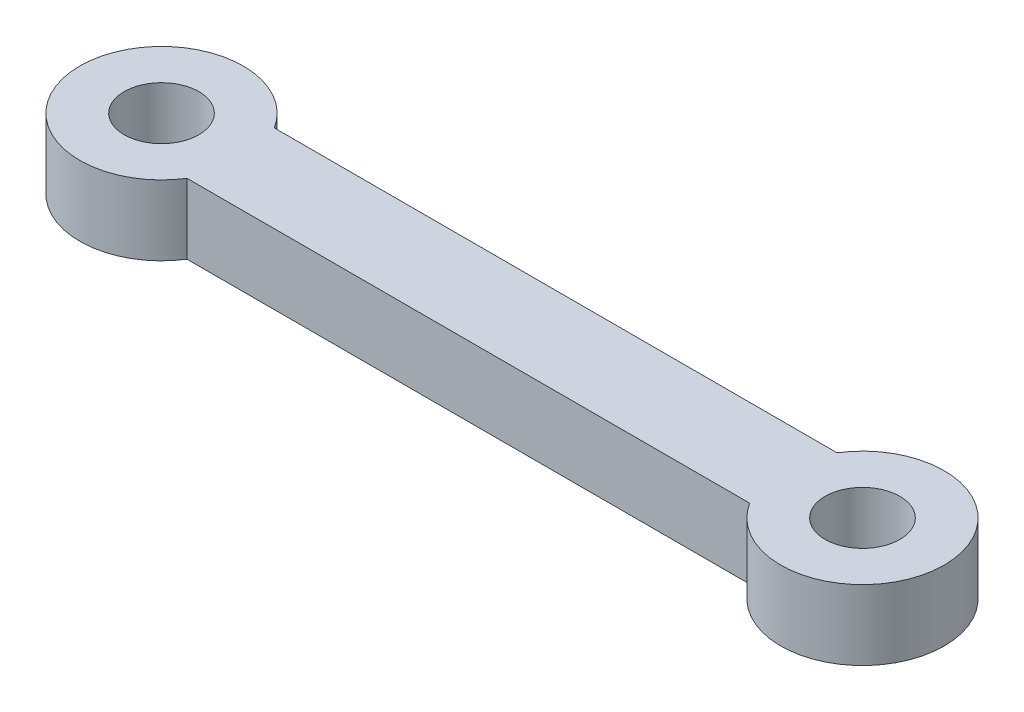
ISO-10303-21;
HEADER;
FILE_DESCRIPTION(('STEP AP214'),'2;1');
FILE_NAME('part.step','',(''),(''),'','','');
FILE_SCHEMA(('AUTOMOTIVE_DESIGN { 1 0 10303 214 1 1 1 1 }'));
ENDSEC;
DATA;
#1=APPLICATION_CONTEXT('core data for automotive mechanical design processes');
#2=APPLICATION_PROTOCOL_DEFINITION('international standard','automotive_design',2000,#1);
#3=PRODUCT_CONTEXT('',#1,'mechanical');
#4=PRODUCT('Part','Part','',(#3));
#5=PRODUCT_RELATED_PRODUCT_CATEGORY('part','',(#4));
#6=PRODUCT_DEFINITION_FORMATION('','',#4);
#7=PRODUCT_DEFINITION_CONTEXT('part definition',#1,'design');
#8=PRODUCT_DEFINITION('design','',#6,#7);
#9=PRODUCT_DEFINITION_SHAPE('','',#8);
#10=(LENGTH_UNIT() NAMED_UNIT(*) SI_UNIT(.MILLI.,.METRE.));
#11=(NAMED_UNIT(*) PLANE_ANGLE_UNIT() SI_UNIT($,.RADIAN.));
#12=(NAMED_UNIT(*) SI_UNIT($,.STERADIAN.) SOLID_ANGLE_UNIT());
#13=UNCERTAINTY_MEASURE_WITH_UNIT(LENGTH_MEASURE(1.E-05),#10,'distance_accuracy_value','');
#14=(GEOMETRIC_REPRESENTATION_CONTEXT(3) GLOBAL_UNCERTAINTY_ASSIGNED_CONTEXT((#13)) GLOBAL_UNIT_ASSIGNED_CONTEXT((#10,
#11,#12)) REPRESENTATION_CONTEXT('',''));
#15=CARTESIAN_POINT('',(0.,0.,0.));
#16=DIRECTION('',(0.,0.,1.));
#17=DIRECTION('',(1.,0.,0.));
#18=AXIS2_PLACEMENT_3D('',#15,#16,#17);
#19=CARTESIAN_POINT('',(0.,3.,0.));
#20=DIRECTION('',(0.,-1.,0.));
#21=DIRECTION('',(0.,0.,-1.));
#22=AXIS2_PLACEMENT_3D('',#19,#20,#21);
#23=CYLINDRICAL_SURFACE('',#22,3.5);
#24=CARTESIAN_POINT('',(0.,0.,0.));
#25=DIRECTION('',(0.,1.,0.));
#26=DIRECTION('',(0.,0.,1.));
#27=AXIS2_PLACEMENT_3D('',#24,#25,#26);
#28=CIRCLE('',#27,3.5);
#29=CARTESIAN_POINT('',(2.95977909864807,0.,-1.86807593186305));
#30=VERTEX_POINT('',#29);
#31=CARTESIAN_POINT('',(2.95977909864807,0.,1.86807593186305));
#32=VERTEX_POINT('',#31);
#33=EDGE_CURVE('E119',#30,#32,#28,.T.);
#34=ORIENTED_EDGE('',*,*,#33,.T.);
#35=DIRECTION('',(0.,-1.,0.));
#36=VECTOR('',#35,1.);
#37=CARTESIAN_POINT('',(2.95977909864807,3.,1.86807593186305));
#38=LINE('',#37,#36);
#39=CARTESIAN_POINT('',(2.95977909864807,3.,1.86807593186305));
#40=VERTEX_POINT('',#39);
#41=EDGE_CURVE('E11',#40,#32,#38,.T.);
#42=ORIENTED_EDGE('',*,*,#41,.F.);
#43=CARTESIAN_POINT('',(0.,3.,0.));
#44=DIRECTION('',(0.,1.,0.));
#45=DIRECTION('',(0.,0.,1.));
#46=AXIS2_PLACEMENT_3D('',#43,#44,#45);
#47=CIRCLE('',#46,3.5);
#48=CARTESIAN_POINT('',(2.95977909864807,3.,-1.86807593186305));
#49=VERTEX_POINT('',#48);
#50=EDGE_CURVE('E93',#49,#40,#47,.T.);
#51=ORIENTED_EDGE('',*,*,#50,.F.);
#52=DIRECTION('',(0.,-1.,0.));
#53=VECTOR('',#52,1.);
#54=CARTESIAN_POINT('',(2.95977909864807,3.,-1.86807593186305));
#55=LINE('',#54,#53);
#56=EDGE_CURVE('E59',#49,#30,#55,.T.);
#57=ORIENTED_EDGE('',*,*,#56,.T.);
#58=EDGE_LOOP('',(#34,#42,#51,#57));
#59=FACE_BOUND('',#58,.T.);
#60=ADVANCED_FACE('F41',(#59),#23,.T.);
#61=CARTESIAN_POINT('',(0.,3.,1.86807593186305));
#62=DIRECTION('',(0.,0.,-1.));
#63=DIRECTION('',(-1.,0.,0.));
#64=AXIS2_PLACEMENT_3D('',#61,#62,#63);
#65=PLANE('',#64);
#66=DIRECTION('',(1.,0.,0.));
#67=VECTOR('',#66,1.);
#68=CARTESIAN_POINT('',(0.,0.,1.86807593186305));
#69=LINE('',#68,#67);
#70=CARTESIAN_POINT('',(27.0402209013519,0.,1.86807593186305));
#71=VERTEX_POINT('',#70);
#72=EDGE_CURVE('E99',#32,#71,#69,.T.);
#73=ORIENTED_EDGE('',*,*,#72,.T.);
#74=DIRECTION('',(0.,-1.,0.));
#75=VECTOR('',#74,1.);
#76=CARTESIAN_POINT('',(27.0402209013519,3.,1.86807593186305));
#77=LINE('',#76,#75);
#78=CARTESIAN_POINT('',(27.0402209013519,3.,1.86807593186305));
#79=VERTEX_POINT('',#78);
#80=EDGE_CURVE('E51',#79,#71,#77,.T.);
#81=ORIENTED_EDGE('',*,*,#80,.F.);
#82=DIRECTION('',(1.,0.,0.));
#83=VECTOR('',#82,1.);
#84=CARTESIAN_POINT('',(0.,3.,1.86807593186305));
#85=LINE('',#84,#83);
#86=EDGE_CURVE('E85',#40,#79,#85,.T.);
#87=ORIENTED_EDGE('',*,*,#86,.F.);
#88=ORIENTED_EDGE('',*,*,#41,.T.);
#89=EDGE_LOOP('',(#73,#81,#87,#88));
#90=FACE_BOUND('',#89,.T.);
#91=ADVANCED_FACE('F98',(#90),#65,.F.);
#92=CARTESIAN_POINT('',(30.,3.,0.));
#93=DIRECTION('',(0.,-1.,0.));
#94=DIRECTION('',(0.,0.,-1.));
#95=AXIS2_PLACEMENT_3D('',#92,#93,#94);
#96=CYLINDRICAL_SURFACE('',#95,3.5);
#97=CARTESIAN_POINT('',(30.,0.,0.));
#98=DIRECTION('',(0.,1.,0.));
#99=DIRECTION('',(0.,0.,1.));
#100=AXIS2_PLACEMENT_3D('',#97,#98,#99);
#101=CIRCLE('',#100,3.5);
#102=CARTESIAN_POINT('',(27.0402209013519,0.,-1.86807593186305));
#103=VERTEX_POINT('',#102);
#104=EDGE_CURVE('E124',#71,#103,#101,.T.);
#105=ORIENTED_EDGE('',*,*,#104,.T.);
#106=DIRECTION('',(0.,-1.,0.));
#107=VECTOR('',#106,1.);
#108=CARTESIAN_POINT('',(27.0402209013519,3.,-1.86807593186305));
#109=LINE('',#108,#107);
#110=CARTESIAN_POINT('',(27.0402209013519,3.,-1.86807593186305));
#111=VERTEX_POINT('',#110);
#112=EDGE_CURVE('E74',#111,#103,#109,.T.);
#113=ORIENTED_EDGE('',*,*,#112,.F.);
#114=CARTESIAN_POINT('',(30.,3.,0.));
#115=DIRECTION('',(0.,1.,0.));
#116=DIRECTION('',(0.,0.,1.));
#117=AXIS2_PLACEMENT_3D('',#114,#115,#116);
#118=CIRCLE('',#117,3.5);
#119=EDGE_CURVE('E92',#79,#111,#118,.T.);
#120=ORIENTED_EDGE('',*,*,#119,.F.);
#121=ORIENTED_EDGE('',*,*,#80,.T.);
#122=EDGE_LOOP('',(#105,#113,#120,#121));
#123=FACE_BOUND('',#122,.T.);
#124=ADVANCED_FACE('F103',(#123),#96,.T.);
#125=CARTESIAN_POINT('',(0.,3.,-1.86807593186305));
#126=DIRECTION('',(0.,0.,-1.));
#127=DIRECTION('',(-1.,0.,0.));
#128=AXIS2_PLACEMENT_3D('',#125,#126,#127);
#129=PLANE('',#128);
#130=DIRECTION('',(1.,0.,0.));
#131=VECTOR('',#130,1.);
#132=CARTESIAN_POINT('',(0.,0.,-1.86807593186305));
#133=LINE('',#132,#131);
#134=EDGE_CURVE('E127',#30,#103,#133,.T.);
#135=ORIENTED_EDGE('',*,*,#134,.F.);
#136=ORIENTED_EDGE('',*,*,#56,.F.);
#137=DIRECTION('',(1.,0.,0.));
#138=VECTOR('',#137,1.);
#139=CARTESIAN_POINT('',(0.,3.,-1.86807593186305));
#140=LINE('',#139,#138);
#141=EDGE_CURVE('E105',#49,#111,#140,.T.);
#142=ORIENTED_EDGE('',*,*,#141,.T.);
#143=ORIENTED_EDGE('',*,*,#112,.T.);
#144=EDGE_LOOP('',(#135,#136,#142,#143));
#145=FACE_BOUND('',#144,.T.);
#146=ADVANCED_FACE('F169',(#145),#129,.T.);
#147=CARTESIAN_POINT('',(0.,3.,0.));
#148=DIRECTION('',(0.,-1.,0.));
#149=DIRECTION('',(0.,0.,-1.));
#150=AXIS2_PLACEMENT_3D('',#147,#148,#149);
#151=CYLINDRICAL_SURFACE('',#150,1.6);
#152=CARTESIAN_POINT('',(0.,3.,0.));
#153=DIRECTION('',(0.,1.,0.));
#154=DIRECTION('',(0.,0.,1.));
#155=AXIS2_PLACEMENT_3D('',#152,#153,#154);
#156=CIRCLE('',#155,1.6);
#157=CARTESIAN_POINT('',(0.,3.,1.6));
#158=VERTEX_POINT('',#157);
#159=EDGE_CURVE('E135',#158,#158,#156,.T.);
#160=ORIENTED_EDGE('',*,*,#159,.T.);
#161=EDGE_LOOP('',(#160));
#162=FACE_BOUND('',#161,.T.);
#163=CARTESIAN_POINT('',(0.,0.,0.));
#164=DIRECTION('',(0.,1.,0.));
#165=DIRECTION('',(0.,0.,1.));
#166=AXIS2_PLACEMENT_3D('',#163,#164,#165);
#167=CIRCLE('',#166,1.6);
#168=CARTESIAN_POINT('',(0.,0.,1.6));
#169=VERTEX_POINT('',#168);
#170=EDGE_CURVE('E115',#169,#169,#167,.T.);
#171=ORIENTED_EDGE('',*,*,#170,.F.);
#172=EDGE_LOOP('',(#171));
#173=FACE_BOUND('',#172,.T.);
#174=ADVANCED_FACE('F43',(#162,#173),#151,.F.);
#175=CARTESIAN_POINT('',(30.,3.,0.));
#176=DIRECTION('',(0.,-1.,0.));
#177=DIRECTION('',(0.,0.,-1.));
#178=AXIS2_PLACEMENT_3D('',#175,#176,#177);
#179=CYLINDRICAL_SURFACE('',#178,1.6);
#180=CARTESIAN_POINT('',(30.,3.,0.));
#181=DIRECTION('',(0.,1.,0.));
#182=DIRECTION('',(0.,0.,1.));
#183=AXIS2_PLACEMENT_3D('',#180,#181,#182);
#184=CIRCLE('',#183,1.6);
#185=CARTESIAN_POINT('',(30.,3.,1.6));
#186=VERTEX_POINT('',#185);
#187=EDGE_CURVE('E108',#186,#186,#184,.T.);
#188=ORIENTED_EDGE('',*,*,#187,.T.);
#189=EDGE_LOOP('',(#188));
#190=FACE_BOUND('',#189,.T.);
#191=CARTESIAN_POINT('',(30.,0.,0.));
#192=DIRECTION('',(0.,1.,0.));
#193=DIRECTION('',(0.,0.,1.));
#194=AXIS2_PLACEMENT_3D('',#191,#192,#193);
#195=CIRCLE('',#194,1.6);
#196=CARTESIAN_POINT('',(30.,0.,1.6));
#197=VERTEX_POINT('',#196);
#198=EDGE_CURVE('E131',#197,#197,#195,.T.);
#199=ORIENTED_EDGE('',*,*,#198,.F.);
#200=EDGE_LOOP('',(#199));
#201=FACE_BOUND('',#200,.T.);
#202=ADVANCED_FACE('F151',(#190,#201),#179,.F.);
#203=CARTESIAN_POINT('',(0.,3.,0.));
#204=DIRECTION('',(0.,1.,0.));
#205=DIRECTION('',(0.,0.,1.));
#206=AXIS2_PLACEMENT_3D('',#203,#204,#205);
#207=PLANE('',#206);
#208=ORIENTED_EDGE('',*,*,#159,.F.);
#209=EDGE_LOOP('',(#208));
#210=FACE_BOUND('',#209,.T.);
#211=ORIENTED_EDGE('',*,*,#50,.T.);
#212=ORIENTED_EDGE('',*,*,#86,.T.);
#213=ORIENTED_EDGE('',*,*,#119,.T.);
#214=ORIENTED_EDGE('',*,*,#141,.F.);
#215=EDGE_LOOP('',(#211,#212,#213,#214));
#216=FACE_BOUND('',#215,.T.);
#217=ORIENTED_EDGE('',*,*,#187,.F.);
#218=EDGE_LOOP('',(#217));
#219=FACE_BOUND('',#218,.T.);
#220=ADVANCED_FACE('F88',(#210,#216,#219),#207,.T.);
#221=CARTESIAN_POINT('',(0.,0.,0.));
#222=DIRECTION('',(0.,1.,0.));
#223=DIRECTION('',(0.,0.,1.));
#224=AXIS2_PLACEMENT_3D('',#221,#222,#223);
#225=PLANE('',#224);
#226=ORIENTED_EDGE('',*,*,#170,.T.);
#227=EDGE_LOOP('',(#226));
#228=FACE_BOUND('',#227,.T.);
#229=ORIENTED_EDGE('',*,*,#33,.F.);
#230=ORIENTED_EDGE('',*,*,#134,.T.);
#231=ORIENTED_EDGE('',*,*,#104,.F.);
#232=ORIENTED_EDGE('',*,*,#72,.F.);
#233=EDGE_LOOP('',(#229,#230,#231,#232));
#234=FACE_BOUND('',#233,.T.);
#235=ORIENTED_EDGE('',*,*,#198,.T.);
#236=EDGE_LOOP('',(#235));
#237=FACE_BOUND('',#236,.T.);
#238=ADVANCED_FACE('F150',(#228,#234,#237),#225,.F.);
#239=CLOSED_SHELL('',(#60,#91,#124,#146,#174,#202,#220,#238));
#240=MANIFOLD_SOLID_BREP('B2',#239);
#241=ADVANCED_BREP_SHAPE_REPRESENTATION('',(#18,#240),#14);
#242=SHAPE_DEFINITION_REPRESENTATION(#9,#241);
ENDSEC;
END-ISO-10303-21;
